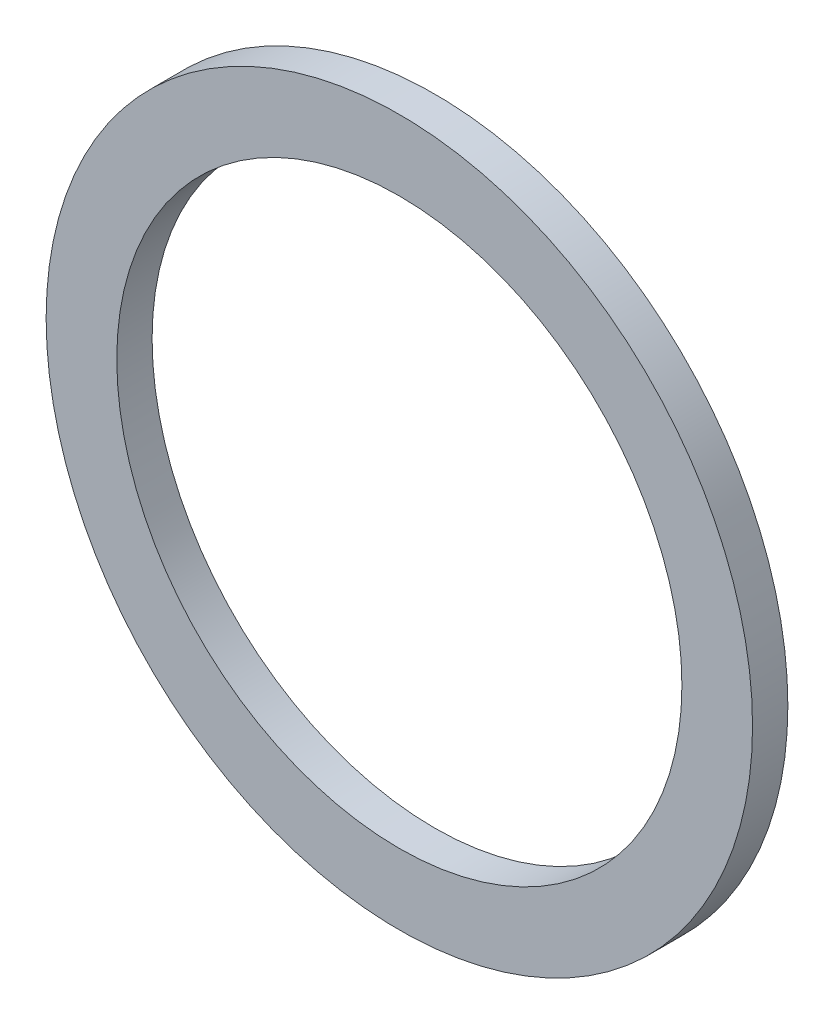
ISO-10303-21;
HEADER;
FILE_DESCRIPTION(('STEP AP214'),'2;1');
FILE_NAME('part.step','',(''),(''),'','','');
FILE_SCHEMA(('AUTOMOTIVE_DESIGN { 1 0 10303 214 1 1 1 1 }'));
ENDSEC;
DATA;
#1=APPLICATION_CONTEXT('core data for automotive mechanical design processes');
#2=APPLICATION_PROTOCOL_DEFINITION('international standard','automotive_design',2000,#1);
#3=PRODUCT_CONTEXT('',#1,'mechanical');
#4=PRODUCT('Part','Part','',(#3));
#5=PRODUCT_RELATED_PRODUCT_CATEGORY('part','',(#4));
#6=PRODUCT_DEFINITION_FORMATION('','',#4);
#7=PRODUCT_DEFINITION_CONTEXT('part definition',#1,'design');
#8=PRODUCT_DEFINITION('design','',#6,#7);
#9=PRODUCT_DEFINITION_SHAPE('','',#8);
#10=(LENGTH_UNIT() NAMED_UNIT(*) SI_UNIT(.MILLI.,.METRE.));
#11=(NAMED_UNIT(*) PLANE_ANGLE_UNIT() SI_UNIT($,.RADIAN.));
#12=(NAMED_UNIT(*) SI_UNIT($,.STERADIAN.) SOLID_ANGLE_UNIT());
#13=UNCERTAINTY_MEASURE_WITH_UNIT(LENGTH_MEASURE(1.E-05),#10,'distance_accuracy_value','');
#14=(GEOMETRIC_REPRESENTATION_CONTEXT(3) GLOBAL_UNCERTAINTY_ASSIGNED_CONTEXT((#13)) GLOBAL_UNIT_ASSIGNED_CONTEXT((#10,
#11,#12)) REPRESENTATION_CONTEXT('',''));
#15=CARTESIAN_POINT('',(0.,0.,0.));
#16=DIRECTION('',(0.,0.,1.));
#17=DIRECTION('',(1.,0.,0.));
#18=AXIS2_PLACEMENT_3D('',#15,#16,#17);
#19=CARTESIAN_POINT('',(8.00000011920929,-9.00000002980232,2.));
#20=DIRECTION('',(0.,0.,-1.));
#21=DIRECTION('',(0.,-1.,0.));
#22=AXIS2_PLACEMENT_3D('',#19,#20,#21);
#23=PLANE('',#22);
#24=CARTESIAN_POINT('',(8.00000011920929,-9.00000002980232,2.));
#25=DIRECTION('',(0.,0.,1.));
#26=DIRECTION('',(1.,0.,0.));
#27=AXIS2_PLACEMENT_3D('',#24,#25,#26);
#28=CIRCLE('',#27,0.800000014901161);
#29=CARTESIAN_POINT('',(7.20000010430813,-9.00000002980232,2.));
#30=VERTEX_POINT('',#29);
#31=EDGE_CURVE('E47',#30,#30,#28,.T.);
#32=ORIENTED_EDGE('',*,*,#31,.T.);
#33=EDGE_LOOP('',(#32));
#34=FACE_BOUND('',#33,.T.);
#35=CARTESIAN_POINT('',(8.00000011920929,-9.00000002980232,2.));
#36=DIRECTION('',(0.,0.,-1.));
#37=DIRECTION('',(1.,0.,0.));
#38=AXIS2_PLACEMENT_3D('',#35,#36,#37);
#39=CIRCLE('',#38,1.00000001490116);
#40=CARTESIAN_POINT('',(7.00000010430813,-9.00000002980232,2.));
#41=VERTEX_POINT('',#40);
#42=EDGE_CURVE('E11',#41,#41,#39,.T.);
#43=ORIENTED_EDGE('',*,*,#42,.T.);
#44=EDGE_LOOP('',(#43));
#45=FACE_BOUND('',#44,.T.);
#46=ADVANCED_FACE('F17',(#34,#45),#23,.T.);
#47=CARTESIAN_POINT('',(8.00000011920929,-9.00000002980232,2.1));
#48=DIRECTION('',(0.,0.,-1.));
#49=DIRECTION('',(0.,-1.,0.));
#50=AXIS2_PLACEMENT_3D('',#47,#48,#49);
#51=PLANE('',#50);
#52=CARTESIAN_POINT('',(8.00000011920929,-9.00000002980232,2.1));
#53=DIRECTION('',(0.,0.,1.));
#54=DIRECTION('',(1.,0.,0.));
#55=AXIS2_PLACEMENT_3D('',#52,#53,#54);
#56=CIRCLE('',#55,0.800000014901161);
#57=CARTESIAN_POINT('',(7.20000010430813,-9.00000002980232,2.1));
#58=VERTEX_POINT('',#57);
#59=EDGE_CURVE('E56',#58,#58,#56,.T.);
#60=ORIENTED_EDGE('',*,*,#59,.F.);
#61=EDGE_LOOP('',(#60));
#62=FACE_BOUND('',#61,.T.);
#63=CARTESIAN_POINT('',(8.00000011920929,-9.00000002980232,2.1));
#64=DIRECTION('',(0.,0.,-1.));
#65=DIRECTION('',(1.,0.,0.));
#66=AXIS2_PLACEMENT_3D('',#63,#64,#65);
#67=CIRCLE('',#66,1.00000001490116);
#68=CARTESIAN_POINT('',(7.00000010430813,-9.00000002980232,2.1));
#69=VERTEX_POINT('',#68);
#70=EDGE_CURVE('E62',#69,#69,#67,.T.);
#71=ORIENTED_EDGE('',*,*,#70,.F.);
#72=EDGE_LOOP('',(#71));
#73=FACE_BOUND('',#72,.T.);
#74=ADVANCED_FACE('F19',(#62,#73),#51,.F.);
#75=CARTESIAN_POINT('',(8.00000011920929,-9.00000002980232,2.));
#76=DIRECTION('',(0.,0.,-1.));
#77=DIRECTION('',(1.,0.,0.));
#78=AXIS2_PLACEMENT_3D('',#75,#76,#77);
#79=CYLINDRICAL_SURFACE('',#78,1.00000001490116);
#80=ORIENTED_EDGE('',*,*,#70,.T.);
#81=DIRECTION('',(0.,0.,-1.));
#82=VECTOR('',#81,1.);
#83=CARTESIAN_POINT('',(7.00000010430813,-9.00000002980232,2.));
#84=LINE('',#83,#82);
#85=EDGE_CURVE('E28',#69,#41,#84,.T.);
#86=ORIENTED_EDGE('',*,*,#85,.T.);
#87=ORIENTED_EDGE('',*,*,#42,.F.);
#88=ORIENTED_EDGE('',*,*,#85,.F.);
#89=EDGE_LOOP('',(#80,#86,#87,#88));
#90=FACE_BOUND('',#89,.T.);
#91=ADVANCED_FACE('F73',(#90),#79,.T.);
#92=CARTESIAN_POINT('',(8.00000011920929,-9.00000002980232,2.));
#93=DIRECTION('',(0.,0.,-1.));
#94=DIRECTION('',(1.,0.,0.));
#95=AXIS2_PLACEMENT_3D('',#92,#93,#94);
#96=CYLINDRICAL_SURFACE('',#95,0.800000014901161);
#97=ORIENTED_EDGE('',*,*,#59,.T.);
#98=DIRECTION('',(0.,0.,-1.));
#99=VECTOR('',#98,1.);
#100=CARTESIAN_POINT('',(7.20000010430813,-9.00000002980232,2.));
#101=LINE('',#100,#99);
#102=EDGE_CURVE('E21',#58,#30,#101,.T.);
#103=ORIENTED_EDGE('',*,*,#102,.T.);
#104=ORIENTED_EDGE('',*,*,#31,.F.);
#105=ORIENTED_EDGE('',*,*,#102,.F.);
#106=EDGE_LOOP('',(#97,#103,#104,#105));
#107=FACE_BOUND('',#106,.T.);
#108=ADVANCED_FACE('F54',(#107),#96,.F.);
#109=CLOSED_SHELL('',(#46,#74,#91,#108));
#110=MANIFOLD_SOLID_BREP('B1',#109);
#111=ADVANCED_BREP_SHAPE_REPRESENTATION('',(#18,#110),#14);
#112=SHAPE_DEFINITION_REPRESENTATION(#9,#111);
ENDSEC;
END-ISO-10303-21;
